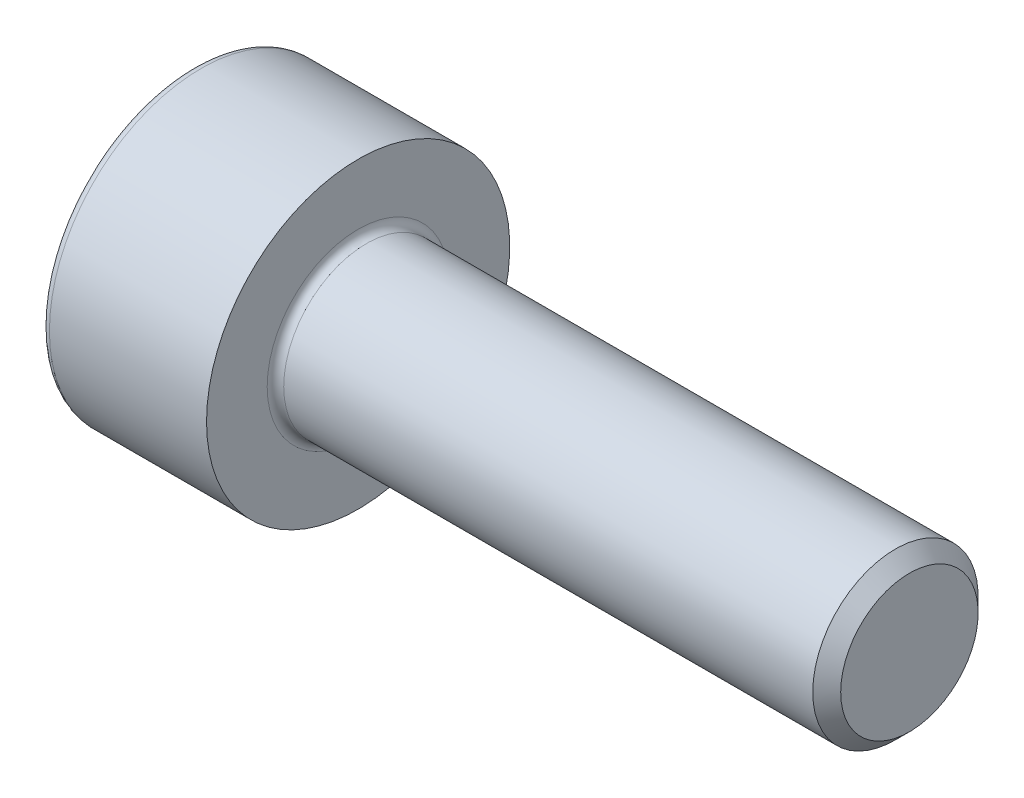
ISO-10303-21;
HEADER;
FILE_DESCRIPTION(('STEP AP214'),'2;1');
FILE_NAME('part.step','',(''),(''),'','','');
FILE_SCHEMA(('AUTOMOTIVE_DESIGN { 1 0 10303 214 1 1 1 1 }'));
ENDSEC;
DATA;
#1=APPLICATION_CONTEXT('core data for automotive mechanical design processes');
#2=APPLICATION_PROTOCOL_DEFINITION('international standard','automotive_design',2000,#1);
#3=PRODUCT_CONTEXT('',#1,'mechanical');
#4=PRODUCT('Part','Part','',(#3));
#5=PRODUCT_RELATED_PRODUCT_CATEGORY('part','',(#4));
#6=PRODUCT_DEFINITION_FORMATION('','',#4);
#7=PRODUCT_DEFINITION_CONTEXT('part definition',#1,'design');
#8=PRODUCT_DEFINITION('design','',#6,#7);
#9=PRODUCT_DEFINITION_SHAPE('','',#8);
#10=(LENGTH_UNIT() NAMED_UNIT(*) SI_UNIT(.MILLI.,.METRE.));
#11=(NAMED_UNIT(*) PLANE_ANGLE_UNIT() SI_UNIT($,.RADIAN.));
#12=(NAMED_UNIT(*) SI_UNIT($,.STERADIAN.) SOLID_ANGLE_UNIT());
#13=UNCERTAINTY_MEASURE_WITH_UNIT(LENGTH_MEASURE(1.E-05),#10,'distance_accuracy_value','');
#14=(GEOMETRIC_REPRESENTATION_CONTEXT(3) GLOBAL_UNCERTAINTY_ASSIGNED_CONTEXT((#13)) GLOBAL_UNIT_ASSIGNED_CONTEXT((#10,
#11,#12)) REPRESENTATION_CONTEXT('',''));
#15=CARTESIAN_POINT('',(0.,0.,0.));
#16=DIRECTION('',(0.,0.,1.));
#17=DIRECTION('',(1.,0.,0.));
#18=AXIS2_PLACEMENT_3D('',#15,#16,#17);
#19=CARTESIAN_POINT('',(10.,0.,0.));
#20=DIRECTION('',(-1.,0.,0.));
#21=DIRECTION('',(0.,0.,1.));
#22=AXIS2_PLACEMENT_3D('',#19,#20,#21);
#23=CONICAL_SURFACE('',#22,1.2464999999935,0.785398163397449);
#24=CARTESIAN_POINT('',(9.7464999999935,0.,0.));
#25=DIRECTION('',(-1.,0.,0.));
#26=DIRECTION('',(0.,0.,1.));
#27=AXIS2_PLACEMENT_3D('',#24,#25,#26);
#28=CIRCLE('',#27,1.5);
#29=CARTESIAN_POINT('',(9.7464999999935,0.,1.5));
#30=VERTEX_POINT('',#29);
#31=EDGE_CURVE('E11',#30,#30,#28,.T.);
#32=ORIENTED_EDGE('',*,*,#31,.F.);
#33=EDGE_LOOP('',(#32));
#34=FACE_BOUND('',#33,.T.);
#35=CARTESIAN_POINT('',(10.,0.,0.));
#36=DIRECTION('',(-1.,0.,0.));
#37=DIRECTION('',(0.,0.,1.));
#38=AXIS2_PLACEMENT_3D('',#35,#36,#37);
#39=CIRCLE('',#38,1.2464999999935);
#40=CARTESIAN_POINT('',(10.,0.,1.2464999999935));
#41=VERTEX_POINT('',#40);
#42=EDGE_CURVE('E134',#41,#41,#39,.T.);
#43=ORIENTED_EDGE('',*,*,#42,.T.);
#44=EDGE_LOOP('',(#43));
#45=FACE_BOUND('',#44,.T.);
#46=ADVANCED_FACE('F33',(#34,#45),#23,.T.);
#47=CARTESIAN_POINT('',(-3.,0.,0.));
#48=DIRECTION('',(-1.,0.,0.));
#49=DIRECTION('',(0.,0.,1.));
#50=AXIS2_PLACEMENT_3D('',#47,#48,#49);
#51=CYLINDRICAL_SURFACE('',#50,1.5);
#52=CARTESIAN_POINT('',(0.15,0.,0.));
#53=DIRECTION('',(-1.,0.,0.));
#54=DIRECTION('',(0.,0.,1.));
#55=AXIS2_PLACEMENT_3D('',#52,#53,#54);
#56=CIRCLE('',#55,1.5);
#57=CARTESIAN_POINT('',(0.15,0.,1.5));
#58=VERTEX_POINT('',#57);
#59=EDGE_CURVE('E40',#58,#58,#56,.T.);
#60=ORIENTED_EDGE('',*,*,#59,.F.);
#61=EDGE_LOOP('',(#60));
#62=FACE_BOUND('',#61,.T.);
#63=ORIENTED_EDGE('',*,*,#31,.T.);
#64=EDGE_LOOP('',(#63));
#65=FACE_BOUND('',#64,.T.);
#66=ADVANCED_FACE('F158',(#62,#65),#51,.T.);
#67=CARTESIAN_POINT('',(0.15,0.,0.));
#68=DIRECTION('',(-1.,0.,0.));
#69=DIRECTION('',(0.,0.,1.));
#70=AXIS2_PLACEMENT_3D('',#67,#68,#69);
#71=TOROIDAL_SURFACE('',#70,1.65,0.15);
#72=CARTESIAN_POINT('',(0.,0.,0.));
#73=DIRECTION('',(-1.,0.,0.));
#74=DIRECTION('',(0.,0.,1.));
#75=AXIS2_PLACEMENT_3D('',#72,#73,#74);
#76=CIRCLE('',#75,1.65);
#77=CARTESIAN_POINT('',(0.,0.,1.65));
#78=VERTEX_POINT('',#77);
#79=EDGE_CURVE('E151',#78,#78,#76,.T.);
#80=ORIENTED_EDGE('',*,*,#79,.F.);
#81=EDGE_LOOP('',(#80));
#82=FACE_BOUND('',#81,.T.);
#83=ORIENTED_EDGE('',*,*,#59,.T.);
#84=EDGE_LOOP('',(#83));
#85=FACE_BOUND('',#84,.T.);
#86=ADVANCED_FACE('F156',(#82,#85),#71,.F.);
#87=CARTESIAN_POINT('',(0.,1.65,0.));
#88=DIRECTION('',(-1.,0.,0.));
#89=DIRECTION('',(0.,0.,1.));
#90=AXIS2_PLACEMENT_3D('',#87,#88,#89);
#91=PLANE('',#90);
#92=CARTESIAN_POINT('',(0.,0.,0.));
#93=DIRECTION('',(-1.,0.,0.));
#94=DIRECTION('',(0.,0.,1.));
#95=AXIS2_PLACEMENT_3D('',#92,#93,#94);
#96=CIRCLE('',#95,2.75);
#97=CARTESIAN_POINT('',(0.,0.,2.75));
#98=VERTEX_POINT('',#97);
#99=EDGE_CURVE('E148',#98,#98,#96,.T.);
#100=ORIENTED_EDGE('',*,*,#99,.F.);
#101=EDGE_LOOP('',(#100));
#102=FACE_BOUND('',#101,.T.);
#103=ORIENTED_EDGE('',*,*,#79,.T.);
#104=EDGE_LOOP('',(#103));
#105=FACE_BOUND('',#104,.T.);
#106=ADVANCED_FACE('F189',(#102,#105),#91,.F.);
#107=CARTESIAN_POINT('',(-3.,0.,0.));
#108=DIRECTION('',(-1.,0.,0.));
#109=DIRECTION('',(0.,0.,1.));
#110=AXIS2_PLACEMENT_3D('',#107,#108,#109);
#111=CYLINDRICAL_SURFACE('',#110,2.75);
#112=CARTESIAN_POINT('',(-2.85,0.,0.));
#113=DIRECTION('',(-1.,0.,0.));
#114=DIRECTION('',(0.,0.,1.));
#115=AXIS2_PLACEMENT_3D('',#112,#113,#114);
#116=CIRCLE('',#115,2.75);
#117=CARTESIAN_POINT('',(-2.85,0.,2.75));
#118=VERTEX_POINT('',#117);
#119=EDGE_CURVE('E145',#118,#118,#116,.T.);
#120=ORIENTED_EDGE('',*,*,#119,.F.);
#121=EDGE_LOOP('',(#120));
#122=FACE_BOUND('',#121,.T.);
#123=ORIENTED_EDGE('',*,*,#99,.T.);
#124=EDGE_LOOP('',(#123));
#125=FACE_BOUND('',#124,.T.);
#126=ADVANCED_FACE('F185',(#122,#125),#111,.T.);
#127=CARTESIAN_POINT('',(-2.85,0.,0.));
#128=DIRECTION('',(-1.,0.,0.));
#129=DIRECTION('',(0.,0.,1.));
#130=AXIS2_PLACEMENT_3D('',#127,#128,#129);
#131=TOROIDAL_SURFACE('',#130,2.6,0.15);
#132=CARTESIAN_POINT('',(-3.,0.,0.));
#133=DIRECTION('',(-1.,0.,0.));
#134=DIRECTION('',(0.,0.,1.));
#135=AXIS2_PLACEMENT_3D('',#132,#133,#134);
#136=CIRCLE('',#135,2.6);
#137=CARTESIAN_POINT('',(-3.,0.,2.6));
#138=VERTEX_POINT('',#137);
#139=EDGE_CURVE('E142',#138,#138,#136,.T.);
#140=ORIENTED_EDGE('',*,*,#139,.F.);
#141=EDGE_LOOP('',(#140));
#142=FACE_BOUND('',#141,.T.);
#143=ORIENTED_EDGE('',*,*,#119,.T.);
#144=EDGE_LOOP('',(#143));
#145=FACE_BOUND('',#144,.T.);
#146=ADVANCED_FACE('F178',(#142,#145),#131,.T.);
#147=CARTESIAN_POINT('',(-3.,2.6,0.));
#148=DIRECTION('',(1.,0.,0.));
#149=DIRECTION('',(0.,0.,-1.));
#150=AXIS2_PLACEMENT_3D('',#147,#148,#149);
#151=PLANE('',#150);
#152=DIRECTION('',(0.,0.5,-0.866025403784438));
#153=VECTOR('',#152,1.);
#154=CARTESIAN_POINT('',(-3.,0.739008344562721,1.28));
#155=LINE('',#154,#153);
#156=CARTESIAN_POINT('',(-3.,0.739008344562721,1.28));
#157=VERTEX_POINT('',#156);
#158=CARTESIAN_POINT('',(-3.,1.47801668912544,0.));
#159=VERTEX_POINT('',#158);
#160=EDGE_CURVE('E121',#157,#159,#155,.T.);
#161=ORIENTED_EDGE('',*,*,#160,.F.);
#162=DIRECTION('',(0.,1.,0.));
#163=VECTOR('',#162,1.);
#164=CARTESIAN_POINT('',(-3.,-0.739008344562722,1.28));
#165=LINE('',#164,#163);
#166=CARTESIAN_POINT('',(-3.,-0.739008344562722,1.28));
#167=VERTEX_POINT('',#166);
#168=EDGE_CURVE('E47',#167,#157,#165,.T.);
#169=ORIENTED_EDGE('',*,*,#168,.F.);
#170=DIRECTION('',(0.,0.5,0.866025403784439));
#171=VECTOR('',#170,1.);
#172=CARTESIAN_POINT('',(-3.,-1.47801668912544,0.));
#173=LINE('',#172,#171);
#174=CARTESIAN_POINT('',(-3.,-1.47801668912544,0.));
#175=VERTEX_POINT('',#174);
#176=EDGE_CURVE('E130',#175,#167,#173,.T.);
#177=ORIENTED_EDGE('',*,*,#176,.F.);
#178=DIRECTION('',(0.,-0.5,0.866025403784439));
#179=VECTOR('',#178,1.);
#180=CARTESIAN_POINT('',(-3.,-0.739008344562721,-1.28));
#181=LINE('',#180,#179);
#182=CARTESIAN_POINT('',(-3.,-0.739008344562721,-1.28));
#183=VERTEX_POINT('',#182);
#184=EDGE_CURVE('E128',#183,#175,#181,.T.);
#185=ORIENTED_EDGE('',*,*,#184,.F.);
#186=DIRECTION('',(0.,-1.,0.));
#187=VECTOR('',#186,1.);
#188=CARTESIAN_POINT('',(-3.,0.739008344562722,-1.28));
#189=LINE('',#188,#187);
#190=CARTESIAN_POINT('',(-3.,0.739008344562722,-1.28));
#191=VERTEX_POINT('',#190);
#192=EDGE_CURVE('E95',#191,#183,#189,.T.);
#193=ORIENTED_EDGE('',*,*,#192,.F.);
#194=DIRECTION('',(0.,-0.5,-0.866025403784439));
#195=VECTOR('',#194,1.);
#196=CARTESIAN_POINT('',(-3.,1.47801668912544,0.));
#197=LINE('',#196,#195);
#198=EDGE_CURVE('E124',#159,#191,#197,.T.);
#199=ORIENTED_EDGE('',*,*,#198,.F.);
#200=EDGE_LOOP('',(#161,#169,#177,#185,#193,#199));
#201=FACE_BOUND('',#200,.T.);
#202=ORIENTED_EDGE('',*,*,#139,.T.);
#203=EDGE_LOOP('',(#202));
#204=FACE_BOUND('',#203,.T.);
#205=ADVANCED_FACE('F170',(#201,#204),#151,.F.);
#206=CARTESIAN_POINT('',(10.,1.2464999999935,0.));
#207=DIRECTION('',(-1.,0.,0.));
#208=DIRECTION('',(0.,0.,1.));
#209=AXIS2_PLACEMENT_3D('',#206,#207,#208);
#210=PLANE('',#209);
#211=ORIENTED_EDGE('',*,*,#42,.F.);
#212=EDGE_LOOP('',(#211));
#213=FACE_BOUND('',#212,.T.);
#214=ADVANCED_FACE('F167',(#213),#210,.F.);
#215=CARTESIAN_POINT('',(-1.7,-0.739008344562722,1.28));
#216=DIRECTION('',(0.,0.,1.));
#217=DIRECTION('',(1.,0.,0.));
#218=AXIS2_PLACEMENT_3D('',#215,#216,#217);
#219=PLANE('',#218);
#220=ORIENTED_EDGE('',*,*,#168,.T.);
#221=DIRECTION('',(-1.,0.,0.));
#222=VECTOR('',#221,1.);
#223=CARTESIAN_POINT('',(-1.7,0.739008344562721,1.28));
#224=LINE('',#223,#222);
#225=CARTESIAN_POINT('',(-1.7,0.739008344562721,1.28));
#226=VERTEX_POINT('',#225);
#227=EDGE_CURVE('E77',#226,#157,#224,.T.);
#228=ORIENTED_EDGE('',*,*,#227,.F.);
#229=DIRECTION('',(0.,1.,0.));
#230=VECTOR('',#229,1.);
#231=CARTESIAN_POINT('',(-1.7,-0.739008344562722,1.28));
#232=LINE('',#231,#230);
#233=CARTESIAN_POINT('',(-1.7,-0.739008344562722,1.28));
#234=VERTEX_POINT('',#233);
#235=EDGE_CURVE('E132',#234,#226,#232,.T.);
#236=ORIENTED_EDGE('',*,*,#235,.F.);
#237=DIRECTION('',(-1.,0.,0.));
#238=VECTOR('',#237,1.);
#239=CARTESIAN_POINT('',(-1.7,-0.739008344562722,1.28));
#240=LINE('',#239,#238);
#241=EDGE_CURVE('E55',#234,#167,#240,.T.);
#242=ORIENTED_EDGE('',*,*,#241,.T.);
#243=EDGE_LOOP('',(#220,#228,#236,#242));
#244=FACE_BOUND('',#243,.T.);
#245=ADVANCED_FACE('F169',(#244),#219,.F.);
#246=CARTESIAN_POINT('',(-1.7,-1.47801668912544,0.));
#247=DIRECTION('',(0.,-0.866025403784439,0.5));
#248=DIRECTION('',(0.,-0.5,-0.866025403784439));
#249=AXIS2_PLACEMENT_3D('',#246,#247,#248);
#250=PLANE('',#249);
#251=ORIENTED_EDGE('',*,*,#176,.T.);
#252=ORIENTED_EDGE('',*,*,#241,.F.);
#253=DIRECTION('',(0.,0.5,0.866025403784439));
#254=VECTOR('',#253,1.);
#255=CARTESIAN_POINT('',(-1.7,-1.47801668912544,0.));
#256=LINE('',#255,#254);
#257=CARTESIAN_POINT('',(-1.7,-1.47801668912544,0.));
#258=VERTEX_POINT('',#257);
#259=EDGE_CURVE('E107',#258,#234,#256,.T.);
#260=ORIENTED_EDGE('',*,*,#259,.F.);
#261=DIRECTION('',(-1.,0.,0.));
#262=VECTOR('',#261,1.);
#263=CARTESIAN_POINT('',(-1.7,-1.47801668912544,0.));
#264=LINE('',#263,#262);
#265=EDGE_CURVE('E99',#258,#175,#264,.T.);
#266=ORIENTED_EDGE('',*,*,#265,.T.);
#267=EDGE_LOOP('',(#251,#252,#260,#266));
#268=FACE_BOUND('',#267,.T.);
#269=ADVANCED_FACE('F176',(#268),#250,.F.);
#270=CARTESIAN_POINT('',(-1.7,-0.739008344562721,-1.28));
#271=DIRECTION('',(0.,-0.866025403784439,-0.5));
#272=DIRECTION('',(0.,0.5,-0.866025403784439));
#273=AXIS2_PLACEMENT_3D('',#270,#271,#272);
#274=PLANE('',#273);
#275=ORIENTED_EDGE('',*,*,#184,.T.);
#276=ORIENTED_EDGE('',*,*,#265,.F.);
#277=DIRECTION('',(0.,-0.5,0.866025403784439));
#278=VECTOR('',#277,1.);
#279=CARTESIAN_POINT('',(-1.7,-0.739008344562721,-1.28));
#280=LINE('',#279,#278);
#281=CARTESIAN_POINT('',(-1.7,-0.739008344562721,-1.28));
#282=VERTEX_POINT('',#281);
#283=EDGE_CURVE('E103',#282,#258,#280,.T.);
#284=ORIENTED_EDGE('',*,*,#283,.F.);
#285=DIRECTION('',(-1.,0.,0.));
#286=VECTOR('',#285,1.);
#287=CARTESIAN_POINT('',(-1.7,-0.739008344562721,-1.28));
#288=LINE('',#287,#286);
#289=EDGE_CURVE('E88',#282,#183,#288,.T.);
#290=ORIENTED_EDGE('',*,*,#289,.T.);
#291=EDGE_LOOP('',(#275,#276,#284,#290));
#292=FACE_BOUND('',#291,.T.);
#293=ADVANCED_FACE('F104',(#292),#274,.F.);
#294=CARTESIAN_POINT('',(-1.7,0.739008344562722,-1.28));
#295=DIRECTION('',(0.,0.,-1.));
#296=DIRECTION('',(0.,1.,0.));
#297=AXIS2_PLACEMENT_3D('',#294,#295,#296);
#298=PLANE('',#297);
#299=ORIENTED_EDGE('',*,*,#192,.T.);
#300=ORIENTED_EDGE('',*,*,#289,.F.);
#301=DIRECTION('',(0.,-1.,0.));
#302=VECTOR('',#301,1.);
#303=CARTESIAN_POINT('',(-1.7,0.739008344562722,-1.28));
#304=LINE('',#303,#302);
#305=CARTESIAN_POINT('',(-1.7,0.739008344562722,-1.28));
#306=VERTEX_POINT('',#305);
#307=EDGE_CURVE('E92',#306,#282,#304,.T.);
#308=ORIENTED_EDGE('',*,*,#307,.F.);
#309=DIRECTION('',(-1.,0.,0.));
#310=VECTOR('',#309,1.);
#311=CARTESIAN_POINT('',(-1.7,0.739008344562722,-1.28));
#312=LINE('',#311,#310);
#313=EDGE_CURVE('E100',#306,#191,#312,.T.);
#314=ORIENTED_EDGE('',*,*,#313,.T.);
#315=EDGE_LOOP('',(#299,#300,#308,#314));
#316=FACE_BOUND('',#315,.T.);
#317=ADVANCED_FACE('F90',(#316),#298,.F.);
#318=CARTESIAN_POINT('',(-1.7,1.47801668912544,0.));
#319=DIRECTION('',(0.,0.866025403784439,-0.5));
#320=DIRECTION('',(0.,0.5,0.866025403784439));
#321=AXIS2_PLACEMENT_3D('',#318,#319,#320);
#322=PLANE('',#321);
#323=ORIENTED_EDGE('',*,*,#198,.T.);
#324=ORIENTED_EDGE('',*,*,#313,.F.);
#325=DIRECTION('',(0.,-0.5,-0.866025403784439));
#326=VECTOR('',#325,1.);
#327=CARTESIAN_POINT('',(-1.7,1.47801668912544,0.));
#328=LINE('',#327,#326);
#329=CARTESIAN_POINT('',(-1.7,1.47801668912544,0.));
#330=VERTEX_POINT('',#329);
#331=EDGE_CURVE('E113',#330,#306,#328,.T.);
#332=ORIENTED_EDGE('',*,*,#331,.F.);
#333=DIRECTION('',(-1.,0.,0.));
#334=VECTOR('',#333,1.);
#335=CARTESIAN_POINT('',(-1.7,1.47801668912544,0.));
#336=LINE('',#335,#334);
#337=EDGE_CURVE('E137',#330,#159,#336,.T.);
#338=ORIENTED_EDGE('',*,*,#337,.T.);
#339=EDGE_LOOP('',(#323,#324,#332,#338));
#340=FACE_BOUND('',#339,.T.);
#341=ADVANCED_FACE('F251',(#340),#322,.F.);
#342=CARTESIAN_POINT('',(-1.7,0.739008344562721,1.28));
#343=DIRECTION('',(0.,0.866025403784439,0.5));
#344=DIRECTION('',(0.,-0.5,0.866025403784439));
#345=AXIS2_PLACEMENT_3D('',#342,#343,#344);
#346=PLANE('',#345);
#347=ORIENTED_EDGE('',*,*,#160,.T.);
#348=ORIENTED_EDGE('',*,*,#337,.F.);
#349=DIRECTION('',(0.,0.5,-0.866025403784438));
#350=VECTOR('',#349,1.);
#351=CARTESIAN_POINT('',(-1.7,0.739008344562721,1.28));
#352=LINE('',#351,#350);
#353=EDGE_CURVE('E115',#226,#330,#352,.T.);
#354=ORIENTED_EDGE('',*,*,#353,.F.);
#355=ORIENTED_EDGE('',*,*,#227,.T.);
#356=EDGE_LOOP('',(#347,#348,#354,#355));
#357=FACE_BOUND('',#356,.T.);
#358=ADVANCED_FACE('F260',(#357),#346,.F.);
#359=CARTESIAN_POINT('',(-1.7,0.,0.));
#360=DIRECTION('',(-1.,0.,0.));
#361=DIRECTION('',(0.,0.,1.));
#362=AXIS2_PLACEMENT_3D('',#359,#360,#361);
#363=PLANE('',#362);
#364=ORIENTED_EDGE('',*,*,#235,.T.);
#365=ORIENTED_EDGE('',*,*,#353,.T.);
#366=ORIENTED_EDGE('',*,*,#331,.T.);
#367=ORIENTED_EDGE('',*,*,#307,.T.);
#368=ORIENTED_EDGE('',*,*,#283,.T.);
#369=ORIENTED_EDGE('',*,*,#259,.T.);
#370=EDGE_LOOP('',(#364,#365,#366,#367,#368,#369));
#371=FACE_BOUND('',#370,.T.);
#372=ADVANCED_FACE('F110',(#371),#363,.T.);
#373=CLOSED_SHELL('',(#46,#66,#86,#106,#126,#146,#205,#214,#245,#269,#293,#317,#341,#358,#372));
#374=MANIFOLD_SOLID_BREP('B2',#373);
#375=ADVANCED_BREP_SHAPE_REPRESENTATION('',(#18,#374),#14);
#376=SHAPE_DEFINITION_REPRESENTATION(#9,#375);
ENDSEC;
END-ISO-10303-21;
